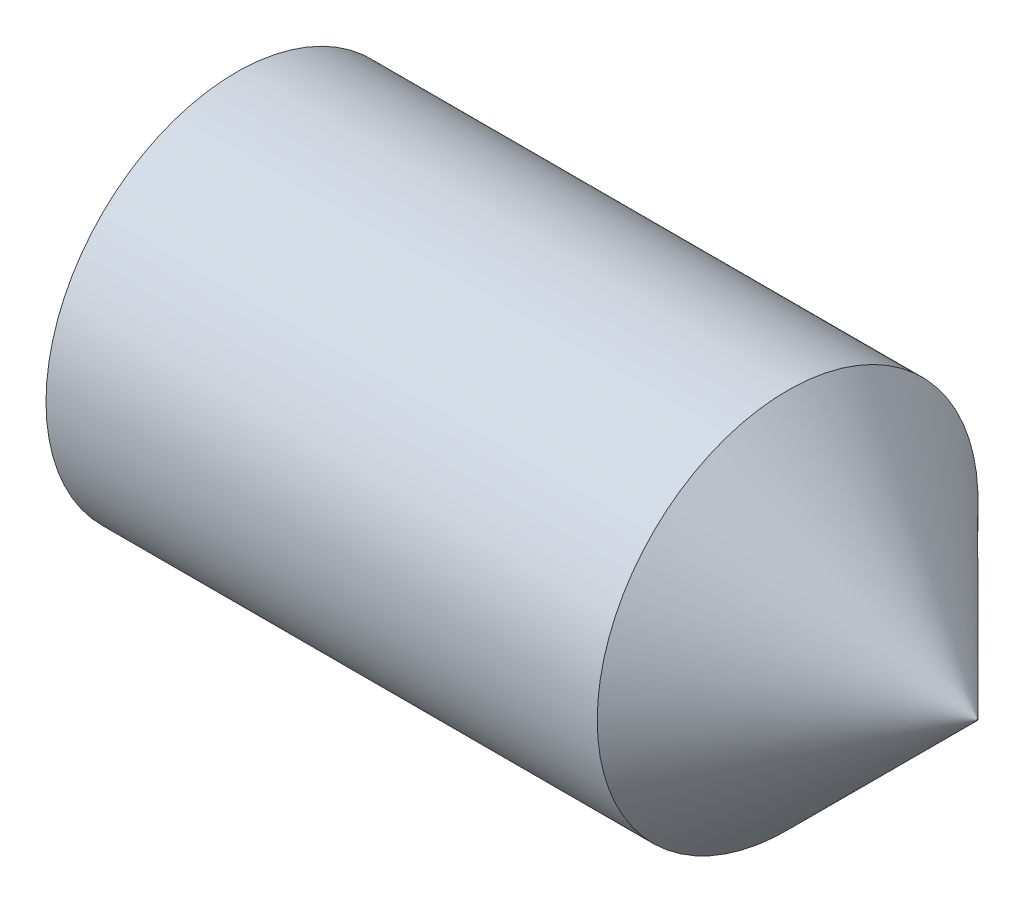
ISO-10303-21;
HEADER;
FILE_DESCRIPTION(('STEP AP214'),'2;1');
FILE_NAME('part.step','',(''),(''),'','','');
FILE_SCHEMA(('AUTOMOTIVE_DESIGN { 1 0 10303 214 1 1 1 1 }'));
ENDSEC;
DATA;
#1=APPLICATION_CONTEXT('core data for automotive mechanical design processes');
#2=APPLICATION_PROTOCOL_DEFINITION('international standard','automotive_design',2000,#1);
#3=PRODUCT_CONTEXT('',#1,'mechanical');
#4=PRODUCT('Part','Part','',(#3));
#5=PRODUCT_RELATED_PRODUCT_CATEGORY('part','',(#4));
#6=PRODUCT_DEFINITION_FORMATION('','',#4);
#7=PRODUCT_DEFINITION_CONTEXT('part definition',#1,'design');
#8=PRODUCT_DEFINITION('design','',#6,#7);
#9=PRODUCT_DEFINITION_SHAPE('','',#8);
#10=(LENGTH_UNIT() NAMED_UNIT(*) SI_UNIT(.MILLI.,.METRE.));
#11=(NAMED_UNIT(*) PLANE_ANGLE_UNIT() SI_UNIT($,.RADIAN.));
#12=(NAMED_UNIT(*) SI_UNIT($,.STERADIAN.) SOLID_ANGLE_UNIT());
#13=UNCERTAINTY_MEASURE_WITH_UNIT(LENGTH_MEASURE(1.E-05),#10,'distance_accuracy_value','');
#14=(GEOMETRIC_REPRESENTATION_CONTEXT(3) GLOBAL_UNCERTAINTY_ASSIGNED_CONTEXT((#13)) GLOBAL_UNIT_ASSIGNED_CONTEXT((#10,
#11,#12)) REPRESENTATION_CONTEXT('',''));
#15=CARTESIAN_POINT('',(0.,0.,0.));
#16=DIRECTION('',(0.,0.,1.));
#17=DIRECTION('',(1.,0.,0.));
#18=AXIS2_PLACEMENT_3D('',#15,#16,#17);
#19=CARTESIAN_POINT('',(0.,0.,0.));
#20=DIRECTION('',(-1.,0.,0.));
#21=DIRECTION('',(0.,0.,1.));
#22=AXIS2_PLACEMENT_3D('',#19,#20,#21);
#23=PLANE('',#22);
#24=CARTESIAN_POINT('',(0.,0.,0.));
#25=DIRECTION('',(-1.,0.,0.));
#26=DIRECTION('',(0.,0.,1.));
#27=AXIS2_PLACEMENT_3D('',#24,#25,#26);
#28=CIRCLE('',#27,1.2195);
#29=CARTESIAN_POINT('',(0.,0.,1.2195));
#30=VERTEX_POINT('',#29);
#31=EDGE_CURVE('E11',#30,#30,#28,.T.);
#32=ORIENTED_EDGE('',*,*,#31,.T.);
#33=EDGE_LOOP('',(#32));
#34=FACE_BOUND('',#33,.T.);
#35=DIRECTION('',(0.,0.,-1.));
#36=VECTOR('',#35,1.);
#37=CARTESIAN_POINT('',(0.,0.750000000000003,0.433012701892217));
#38=LINE('',#37,#36);
#39=CARTESIAN_POINT('',(0.,0.750000000000003,0.433012701892217));
#40=VERTEX_POINT('',#39);
#41=CARTESIAN_POINT('',(0.,0.750000000000003,-0.433012701892222));
#42=VERTEX_POINT('',#41);
#43=EDGE_CURVE('E126',#40,#42,#38,.T.);
#44=ORIENTED_EDGE('',*,*,#43,.F.);
#45=DIRECTION('',(0.,-0.866025403784439,0.5));
#46=VECTOR('',#45,1.);
#47=CARTESIAN_POINT('',(0.,0.750000000000003,0.433012701892217));
#48=LINE('',#47,#46);
#49=CARTESIAN_POINT('',(0.,0.,0.866025403784436));
#50=VERTEX_POINT('',#49);
#51=EDGE_CURVE('E48',#40,#50,#48,.T.);
#52=ORIENTED_EDGE('',*,*,#51,.T.);
#53=DIRECTION('',(0.,0.866025403784439,0.5));
#54=VECTOR('',#53,1.);
#55=CARTESIAN_POINT('',(0.,-0.749999999999997,0.433012701892217));
#56=LINE('',#55,#54);
#57=CARTESIAN_POINT('',(0.,-0.749999999999997,0.433012701892217));
#58=VERTEX_POINT('',#57);
#59=EDGE_CURVE('E117',#58,#50,#56,.T.);
#60=ORIENTED_EDGE('',*,*,#59,.F.);
#61=DIRECTION('',(0.,0.,-1.));
#62=VECTOR('',#61,1.);
#63=CARTESIAN_POINT('',(0.,-0.749999999999997,0.433012701892217));
#64=LINE('',#63,#62);
#65=CARTESIAN_POINT('',(0.,-0.749999999999997,-0.433012701892222));
#66=VERTEX_POINT('',#65);
#67=EDGE_CURVE('E120',#58,#66,#64,.T.);
#68=ORIENTED_EDGE('',*,*,#67,.T.);
#69=DIRECTION('',(0.,0.866025403784438,-0.5));
#70=VECTOR('',#69,1.);
#71=CARTESIAN_POINT('',(0.,-0.749999999999997,-0.433012701892222));
#72=LINE('',#71,#70);
#73=CARTESIAN_POINT('',(0.,0.,-0.866025403784442));
#74=VERTEX_POINT('',#73);
#75=EDGE_CURVE('E123',#66,#74,#72,.T.);
#76=ORIENTED_EDGE('',*,*,#75,.T.);
#77=DIRECTION('',(0.,-0.866025403784439,-0.5));
#78=VECTOR('',#77,1.);
#79=CARTESIAN_POINT('',(0.,0.750000000000003,-0.433012701892222));
#80=LINE('',#79,#78);
#81=EDGE_CURVE('E106',#42,#74,#80,.T.);
#82=ORIENTED_EDGE('',*,*,#81,.F.);
#83=EDGE_LOOP('',(#44,#52,#60,#68,#76,#82));
#84=FACE_BOUND('',#83,.T.);
#85=ADVANCED_FACE('F34',(#34,#84),#23,.T.);
#86=CARTESIAN_POINT('',(0.,0.,0.));
#87=DIRECTION('',(1.,0.,0.));
#88=DIRECTION('',(0.,0.,-1.));
#89=AXIS2_PLACEMENT_3D('',#86,#87,#88);
#90=CONICAL_SURFACE('',#89,1.2195,1.0471975511966);
#91=CARTESIAN_POINT('',(0.161946750507689,0.,0.));
#92=DIRECTION('',(-1.,0.,0.));
#93=DIRECTION('',(0.,0.,1.));
#94=AXIS2_PLACEMENT_3D('',#91,#92,#93);
#95=CIRCLE('',#94,1.5);
#96=CARTESIAN_POINT('',(0.161946750507689,0.,1.5));
#97=VERTEX_POINT('',#96);
#98=EDGE_CURVE('E41',#97,#97,#95,.T.);
#99=ORIENTED_EDGE('',*,*,#98,.T.);
#100=EDGE_LOOP('',(#99));
#101=FACE_BOUND('',#100,.T.);
#102=ORIENTED_EDGE('',*,*,#31,.F.);
#103=EDGE_LOOP('',(#102));
#104=FACE_BOUND('',#103,.T.);
#105=ADVANCED_FACE('F143',(#101,#104),#90,.T.);
#106=CARTESIAN_POINT('',(-12.7,0.,0.));
#107=DIRECTION('',(-1.,0.,0.));
#108=DIRECTION('',(0.,0.,1.));
#109=AXIS2_PLACEMENT_3D('',#106,#107,#108);
#110=CYLINDRICAL_SURFACE('',#109,1.5);
#111=CARTESIAN_POINT('',(4.50500000000001,0.,0.));
#112=DIRECTION('',(-1.,0.,0.));
#113=DIRECTION('',(0.,0.,1.));
#114=AXIS2_PLACEMENT_3D('',#111,#112,#113);
#115=CIRCLE('',#114,1.5);
#116=CARTESIAN_POINT('',(4.50500000000001,0.,1.5));
#117=VERTEX_POINT('',#116);
#118=EDGE_CURVE('E138',#117,#117,#115,.T.);
#119=ORIENTED_EDGE('',*,*,#118,.T.);
#120=EDGE_LOOP('',(#119));
#121=FACE_BOUND('',#120,.T.);
#122=ORIENTED_EDGE('',*,*,#98,.F.);
#123=EDGE_LOOP('',(#122));
#124=FACE_BOUND('',#123,.T.);
#125=ADVANCED_FACE('F146',(#121,#124),#110,.T.);
#126=CARTESIAN_POINT('',(6.,0.,0.));
#127=DIRECTION('',(-1.,0.,0.));
#128=DIRECTION('',(0.,0.,1.));
#129=AXIS2_PLACEMENT_3D('',#126,#127,#128);
#130=CONICAL_SURFACE('',#129,0.0049999999999998,0.785398163397451);
#131=ORIENTED_EDGE('',*,*,#118,.F.);
#132=EDGE_LOOP('',(#131));
#133=FACE_BOUND('',#132,.T.);
#134=CARTESIAN_POINT('',(6.,0.,0.));
#135=DIRECTION('',(-1.,0.,0.));
#136=DIRECTION('',(0.,0.,1.));
#137=AXIS2_PLACEMENT_3D('',#134,#135,#136);
#138=CIRCLE('',#137,0.0049999999999998);
#139=CARTESIAN_POINT('',(6.,0.,0.0049999999999998));
#140=VERTEX_POINT('',#139);
#141=EDGE_CURVE('E135',#140,#140,#138,.T.);
#142=ORIENTED_EDGE('',*,*,#141,.T.);
#143=EDGE_LOOP('',(#142));
#144=FACE_BOUND('',#143,.T.);
#145=ADVANCED_FACE('F148',(#133,#144),#130,.T.);
#146=CARTESIAN_POINT('',(6.,0.,0.));
#147=DIRECTION('',(-1.,0.,0.));
#148=DIRECTION('',(0.,0.,1.));
#149=AXIS2_PLACEMENT_3D('',#146,#147,#148);
#150=PLANE('',#149);
#151=ORIENTED_EDGE('',*,*,#141,.F.);
#152=EDGE_LOOP('',(#151));
#153=FACE_BOUND('',#152,.T.);
#154=ADVANCED_FACE('F155',(#153),#150,.F.);
#155=CARTESIAN_POINT('',(2.1,0.750000000000003,0.433012701892217));
#156=DIRECTION('',(0.,-0.5,-0.866025403784439));
#157=DIRECTION('',(0.,0.866025403784439,-0.5));
#158=AXIS2_PLACEMENT_3D('',#155,#156,#157);
#159=PLANE('',#158);
#160=ORIENTED_EDGE('',*,*,#51,.F.);
#161=DIRECTION('',(-1.,0.,0.));
#162=VECTOR('',#161,1.);
#163=CARTESIAN_POINT('',(2.1,0.750000000000003,0.433012701892217));
#164=LINE('',#163,#162);
#165=CARTESIAN_POINT('',(2.1,0.750000000000003,0.433012701892217));
#166=VERTEX_POINT('',#165);
#167=EDGE_CURVE('E53',#166,#40,#164,.T.);
#168=ORIENTED_EDGE('',*,*,#167,.F.);
#169=DIRECTION('',(0.,-0.866025403784439,0.5));
#170=VECTOR('',#169,1.);
#171=CARTESIAN_POINT('',(2.1,0.750000000000003,0.433012701892217));
#172=LINE('',#171,#170);
#173=CARTESIAN_POINT('',(2.1,0.,0.866025403784436));
#174=VERTEX_POINT('',#173);
#175=EDGE_CURVE('E80',#166,#174,#172,.T.);
#176=ORIENTED_EDGE('',*,*,#175,.T.);
#177=DIRECTION('',(-1.,0.,0.));
#178=VECTOR('',#177,1.);
#179=CARTESIAN_POINT('',(2.1,0.,0.866025403784436));
#180=LINE('',#179,#178);
#181=EDGE_CURVE('E133',#174,#50,#180,.T.);
#182=ORIENTED_EDGE('',*,*,#181,.T.);
#183=EDGE_LOOP('',(#160,#168,#176,#182));
#184=FACE_BOUND('',#183,.T.);
#185=ADVANCED_FACE('F186',(#184),#159,.T.);
#186=CARTESIAN_POINT('',(2.1,-0.749999999999997,0.433012701892217));
#187=DIRECTION('',(0.,-0.5,0.866025403784439));
#188=DIRECTION('',(0.,-0.866025403784439,-0.5));
#189=AXIS2_PLACEMENT_3D('',#186,#187,#188);
#190=PLANE('',#189);
#191=ORIENTED_EDGE('',*,*,#59,.T.);
#192=ORIENTED_EDGE('',*,*,#181,.F.);
#193=DIRECTION('',(0.,0.866025403784439,0.5));
#194=VECTOR('',#193,1.);
#195=CARTESIAN_POINT('',(2.1,-0.749999999999997,0.433012701892217));
#196=LINE('',#195,#194);
#197=CARTESIAN_POINT('',(2.1,-0.749999999999997,0.433012701892217));
#198=VERTEX_POINT('',#197);
#199=EDGE_CURVE('E265',#198,#174,#196,.T.);
#200=ORIENTED_EDGE('',*,*,#199,.F.);
#201=DIRECTION('',(-1.,0.,0.));
#202=VECTOR('',#201,1.);
#203=CARTESIAN_POINT('',(2.1,-0.749999999999997,0.433012701892217));
#204=LINE('',#203,#202);
#205=EDGE_CURVE('E131',#198,#58,#204,.T.);
#206=ORIENTED_EDGE('',*,*,#205,.T.);
#207=EDGE_LOOP('',(#191,#192,#200,#206));
#208=FACE_BOUND('',#207,.T.);
#209=ADVANCED_FACE('F182',(#208),#190,.F.);
#210=CARTESIAN_POINT('',(2.1,-0.749999999999997,0.433012701892217));
#211=DIRECTION('',(0.,1.,0.));
#212=DIRECTION('',(0.,0.,1.));
#213=AXIS2_PLACEMENT_3D('',#210,#211,#212);
#214=PLANE('',#213);
#215=ORIENTED_EDGE('',*,*,#67,.F.);
#216=ORIENTED_EDGE('',*,*,#205,.F.);
#217=DIRECTION('',(0.,0.,-1.));
#218=VECTOR('',#217,1.);
#219=CARTESIAN_POINT('',(2.1,-0.749999999999997,0.433012701892217));
#220=LINE('',#219,#218);
#221=CARTESIAN_POINT('',(2.1,-0.749999999999997,-0.433012701892222));
#222=VERTEX_POINT('',#221);
#223=EDGE_CURVE('E101',#198,#222,#220,.T.);
#224=ORIENTED_EDGE('',*,*,#223,.T.);
#225=DIRECTION('',(-1.,0.,0.));
#226=VECTOR('',#225,1.);
#227=CARTESIAN_POINT('',(2.1,-0.749999999999997,-0.433012701892222));
#228=LINE('',#227,#226);
#229=EDGE_CURVE('E96',#222,#66,#228,.T.);
#230=ORIENTED_EDGE('',*,*,#229,.T.);
#231=EDGE_LOOP('',(#215,#216,#224,#230));
#232=FACE_BOUND('',#231,.T.);
#233=ADVANCED_FACE('F179',(#232),#214,.T.);
#234=CARTESIAN_POINT('',(2.1,-0.749999999999997,-0.433012701892222));
#235=DIRECTION('',(0.,0.5,0.866025403784438));
#236=DIRECTION('',(0.,-0.866025403784439,0.5));
#237=AXIS2_PLACEMENT_3D('',#234,#235,#236);
#238=PLANE('',#237);
#239=ORIENTED_EDGE('',*,*,#75,.F.);
#240=ORIENTED_EDGE('',*,*,#229,.F.);
#241=DIRECTION('',(0.,0.866025403784438,-0.5));
#242=VECTOR('',#241,1.);
#243=CARTESIAN_POINT('',(2.1,-0.749999999999997,-0.433012701892222));
#244=LINE('',#243,#242);
#245=CARTESIAN_POINT('',(2.1,0.,-0.866025403784442));
#246=VERTEX_POINT('',#245);
#247=EDGE_CURVE('E91',#222,#246,#244,.T.);
#248=ORIENTED_EDGE('',*,*,#247,.T.);
#249=DIRECTION('',(-1.,0.,0.));
#250=VECTOR('',#249,1.);
#251=CARTESIAN_POINT('',(2.1,0.,-0.866025403784442));
#252=LINE('',#251,#250);
#253=EDGE_CURVE('E95',#246,#74,#252,.T.);
#254=ORIENTED_EDGE('',*,*,#253,.T.);
#255=EDGE_LOOP('',(#239,#240,#248,#254));
#256=FACE_BOUND('',#255,.T.);
#257=ADVANCED_FACE('F94',(#256),#238,.T.);
#258=CARTESIAN_POINT('',(2.1,0.750000000000003,-0.433012701892222));
#259=DIRECTION('',(0.,0.5,-0.866025403784439));
#260=DIRECTION('',(0.,0.866025403784439,0.5));
#261=AXIS2_PLACEMENT_3D('',#258,#259,#260);
#262=PLANE('',#261);
#263=ORIENTED_EDGE('',*,*,#81,.T.);
#264=ORIENTED_EDGE('',*,*,#253,.F.);
#265=DIRECTION('',(0.,-0.866025403784439,-0.5));
#266=VECTOR('',#265,1.);
#267=CARTESIAN_POINT('',(2.1,0.750000000000003,-0.433012701892222));
#268=LINE('',#267,#266);
#269=CARTESIAN_POINT('',(2.1,0.750000000000003,-0.433012701892222));
#270=VERTEX_POINT('',#269);
#271=EDGE_CURVE('E100',#270,#246,#268,.T.);
#272=ORIENTED_EDGE('',*,*,#271,.F.);
#273=DIRECTION('',(-1.,0.,0.));
#274=VECTOR('',#273,1.);
#275=CARTESIAN_POINT('',(2.1,0.750000000000003,-0.433012701892222));
#276=LINE('',#275,#274);
#277=EDGE_CURVE('E76',#270,#42,#276,.T.);
#278=ORIENTED_EDGE('',*,*,#277,.T.);
#279=EDGE_LOOP('',(#263,#264,#272,#278));
#280=FACE_BOUND('',#279,.T.);
#281=ADVANCED_FACE('F103',(#280),#262,.F.);
#282=CARTESIAN_POINT('',(2.1,0.750000000000003,0.433012701892217));
#283=DIRECTION('',(0.,1.,0.));
#284=DIRECTION('',(0.,0.,1.));
#285=AXIS2_PLACEMENT_3D('',#282,#283,#284);
#286=PLANE('',#285);
#287=ORIENTED_EDGE('',*,*,#43,.T.);
#288=ORIENTED_EDGE('',*,*,#277,.F.);
#289=DIRECTION('',(0.,0.,-1.));
#290=VECTOR('',#289,1.);
#291=CARTESIAN_POINT('',(2.1,0.750000000000003,0.433012701892217));
#292=LINE('',#291,#290);
#293=EDGE_CURVE('E111',#166,#270,#292,.T.);
#294=ORIENTED_EDGE('',*,*,#293,.F.);
#295=ORIENTED_EDGE('',*,*,#167,.T.);
#296=EDGE_LOOP('',(#287,#288,#294,#295));
#297=FACE_BOUND('',#296,.T.);
#298=ADVANCED_FACE('F167',(#297),#286,.F.);
#299=CARTESIAN_POINT('',(2.1,-0.749999999999997,1.29903810567666));
#300=DIRECTION('',(1.,0.,0.));
#301=DIRECTION('',(0.,0.,-1.));
#302=AXIS2_PLACEMENT_3D('',#299,#300,#301);
#303=PLANE('',#302);
#304=ORIENTED_EDGE('',*,*,#175,.F.);
#305=ORIENTED_EDGE('',*,*,#293,.T.);
#306=ORIENTED_EDGE('',*,*,#271,.T.);
#307=ORIENTED_EDGE('',*,*,#247,.F.);
#308=ORIENTED_EDGE('',*,*,#223,.F.);
#309=ORIENTED_EDGE('',*,*,#199,.T.);
#310=EDGE_LOOP('',(#304,#305,#306,#307,#308,#309));
#311=FACE_BOUND('',#310,.T.);
#312=ADVANCED_FACE('F109',(#311),#303,.F.);
#313=CLOSED_SHELL('',(#85,#105,#125,#145,#154,#185,#209,#233,#257,#281,#298,#312));
#314=MANIFOLD_SOLID_BREP('B2',#313);
#315=ADVANCED_BREP_SHAPE_REPRESENTATION('',(#18,#314),#14);
#316=SHAPE_DEFINITION_REPRESENTATION(#9,#315);
ENDSEC;
END-ISO-10303-21;
